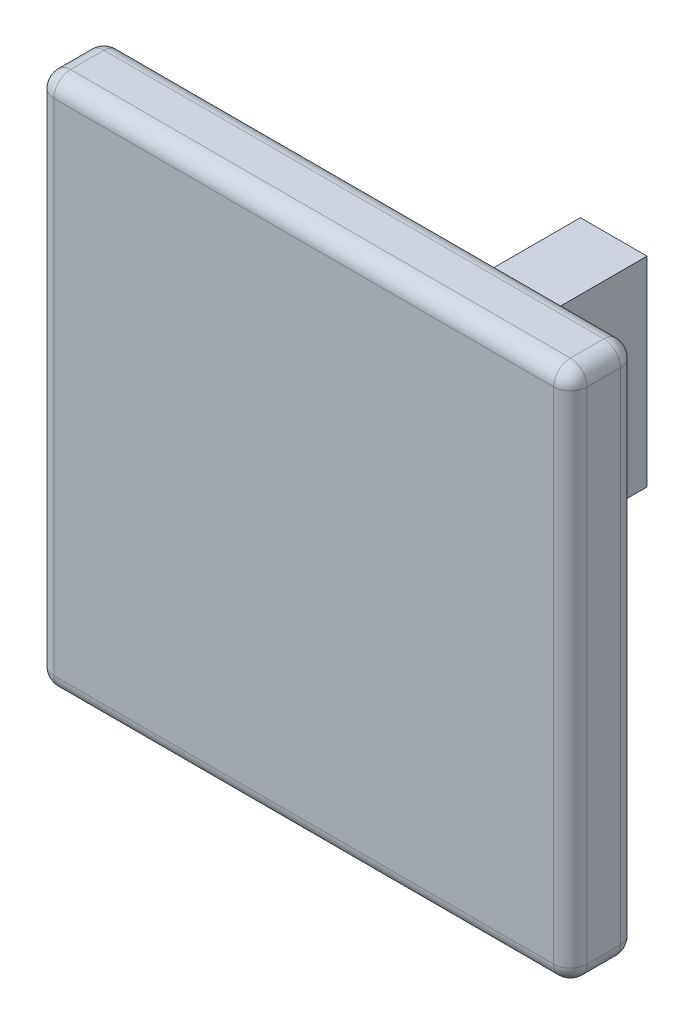
ISO-10303-21;
HEADER;
FILE_DESCRIPTION(('STEP AP214'),'2;1');
FILE_NAME('part.step','',(''),(''),'','','');
FILE_SCHEMA(('AUTOMOTIVE_DESIGN { 1 0 10303 214 1 1 1 1 }'));
ENDSEC;
DATA;
#1=APPLICATION_CONTEXT('core data for automotive mechanical design processes');
#2=APPLICATION_PROTOCOL_DEFINITION('international standard','automotive_design',2000,#1);
#3=PRODUCT_CONTEXT('',#1,'mechanical');
#4=PRODUCT('Part','Part','',(#3));
#5=PRODUCT_RELATED_PRODUCT_CATEGORY('part','',(#4));
#6=PRODUCT_DEFINITION_FORMATION('','',#4);
#7=PRODUCT_DEFINITION_CONTEXT('part definition',#1,'design');
#8=PRODUCT_DEFINITION('design','',#6,#7);
#9=PRODUCT_DEFINITION_SHAPE('','',#8);
#10=(LENGTH_UNIT() NAMED_UNIT(*) SI_UNIT(.MILLI.,.METRE.));
#11=(NAMED_UNIT(*) PLANE_ANGLE_UNIT() SI_UNIT($,.RADIAN.));
#12=(NAMED_UNIT(*) SI_UNIT($,.STERADIAN.) SOLID_ANGLE_UNIT());
#13=UNCERTAINTY_MEASURE_WITH_UNIT(LENGTH_MEASURE(1.E-05),#10,'distance_accuracy_value','');
#14=(GEOMETRIC_REPRESENTATION_CONTEXT(3) GLOBAL_UNCERTAINTY_ASSIGNED_CONTEXT((#13)) GLOBAL_UNIT_ASSIGNED_CONTEXT((#10,
#11,#12)) REPRESENTATION_CONTEXT('',''));
#15=CARTESIAN_POINT('',(0.,0.,0.));
#16=DIRECTION('',(0.,0.,1.));
#17=DIRECTION('',(1.,0.,0.));
#18=AXIS2_PLACEMENT_3D('',#15,#16,#17);
#19=CARTESIAN_POINT('',(0.,6.,0.));
#20=DIRECTION('',(1.,0.,0.));
#21=DIRECTION('',(0.,0.,-1.));
#22=AXIS2_PLACEMENT_3D('',#19,#20,#21);
#23=PLANE('',#22);
#24=DIRECTION('',(0.,0.,1.));
#25=VECTOR('',#24,1.);
#26=CARTESIAN_POINT('',(0.,0.,0.));
#27=LINE('',#26,#25);
#28=CARTESIAN_POINT('',(0.,0.,-7.3));
#29=VERTEX_POINT('',#28);
#30=CARTESIAN_POINT('',(0.,0.,0.));
#31=VERTEX_POINT('',#30);
#32=EDGE_CURVE('E154',#29,#31,#27,.T.);
#33=ORIENTED_EDGE('',*,*,#32,.T.);
#34=DIRECTION('',(0.,-1.,0.));
#35=VECTOR('',#34,1.);
#36=CARTESIAN_POINT('',(0.,6.,0.));
#37=LINE('',#36,#35);
#38=CARTESIAN_POINT('',(0.,6.,0.));
#39=VERTEX_POINT('',#38);
#40=EDGE_CURVE('E158',#39,#31,#37,.T.);
#41=ORIENTED_EDGE('',*,*,#40,.F.);
#42=DIRECTION('',(0.,0.,1.));
#43=VECTOR('',#42,1.);
#44=CARTESIAN_POINT('',(0.,6.,0.));
#45=LINE('',#44,#43);
#46=CARTESIAN_POINT('',(0.,6.,-7.3));
#47=VERTEX_POINT('',#46);
#48=EDGE_CURVE('E579',#47,#39,#45,.T.);
#49=ORIENTED_EDGE('',*,*,#48,.F.);
#50=DIRECTION('',(0.,-1.,0.));
#51=VECTOR('',#50,1.);
#52=CARTESIAN_POINT('',(0.,6.,-7.3));
#53=LINE('',#52,#51);
#54=EDGE_CURVE('E161',#47,#29,#53,.T.);
#55=ORIENTED_EDGE('',*,*,#54,.T.);
#56=EDGE_LOOP('',(#33,#41,#49,#55));
#57=FACE_BOUND('',#56,.T.);
#58=ADVANCED_FACE('F39',(#57),#23,.F.);
#59=CARTESIAN_POINT('',(2.,6.,0.));
#60=DIRECTION('',(-1.,0.,0.));
#61=DIRECTION('',(0.,0.,1.));
#62=AXIS2_PLACEMENT_3D('',#59,#60,#61);
#63=PLANE('',#62);
#64=DIRECTION('',(0.,0.,-1.));
#65=VECTOR('',#64,1.);
#66=CARTESIAN_POINT('',(2.,0.,0.));
#67=LINE('',#66,#65);
#68=CARTESIAN_POINT('',(2.,0.,0.));
#69=VERTEX_POINT('',#68);
#70=CARTESIAN_POINT('',(2.,0.,-7.3));
#71=VERTEX_POINT('',#70);
#72=EDGE_CURVE('E170',#69,#71,#67,.T.);
#73=ORIENTED_EDGE('',*,*,#72,.T.);
#74=DIRECTION('',(0.,-1.,0.));
#75=VECTOR('',#74,1.);
#76=CARTESIAN_POINT('',(2.,6.,-7.3));
#77=LINE('',#76,#75);
#78=CARTESIAN_POINT('',(2.,6.,-7.3));
#79=VERTEX_POINT('',#78);
#80=EDGE_CURVE('E185',#79,#71,#77,.T.);
#81=ORIENTED_EDGE('',*,*,#80,.F.);
#82=DIRECTION('',(0.,0.,-1.));
#83=VECTOR('',#82,1.);
#84=CARTESIAN_POINT('',(2.,6.,0.));
#85=LINE('',#84,#83);
#86=CARTESIAN_POINT('',(2.,6.,0.));
#87=VERTEX_POINT('',#86);
#88=EDGE_CURVE('E591',#87,#79,#85,.T.);
#89=ORIENTED_EDGE('',*,*,#88,.F.);
#90=DIRECTION('',(0.,-1.,0.));
#91=VECTOR('',#90,1.);
#92=CARTESIAN_POINT('',(2.,6.,0.));
#93=LINE('',#92,#91);
#94=EDGE_CURVE('E179',#87,#69,#93,.T.);
#95=ORIENTED_EDGE('',*,*,#94,.T.);
#96=EDGE_LOOP('',(#73,#81,#89,#95));
#97=FACE_BOUND('',#96,.T.);
#98=ADVANCED_FACE('F442',(#97),#63,.F.);
#99=CARTESIAN_POINT('',(0.,6.,-7.3));
#100=DIRECTION('',(0.,0.,1.));
#101=DIRECTION('',(1.,0.,0.));
#102=AXIS2_PLACEMENT_3D('',#99,#100,#101);
#103=PLANE('',#102);
#104=DIRECTION('',(-1.,0.,0.));
#105=VECTOR('',#104,1.);
#106=CARTESIAN_POINT('',(0.,0.,-7.3));
#107=LINE('',#106,#105);
#108=EDGE_CURVE('E575',#71,#29,#107,.T.);
#109=ORIENTED_EDGE('',*,*,#108,.T.);
#110=ORIENTED_EDGE('',*,*,#54,.F.);
#111=DIRECTION('',(-1.,0.,0.));
#112=VECTOR('',#111,1.);
#113=CARTESIAN_POINT('',(0.,6.,-7.3));
#114=LINE('',#113,#112);
#115=EDGE_CURVE('E587',#79,#47,#114,.T.);
#116=ORIENTED_EDGE('',*,*,#115,.F.);
#117=ORIENTED_EDGE('',*,*,#80,.T.);
#118=EDGE_LOOP('',(#109,#110,#116,#117));
#119=FACE_BOUND('',#118,.T.);
#120=ADVANCED_FACE('F447',(#119),#103,.F.);
#121=CARTESIAN_POINT('',(0.,6.,0.));
#122=DIRECTION('',(0.,-1.,0.));
#123=DIRECTION('',(0.,0.,-1.));
#124=AXIS2_PLACEMENT_3D('',#121,#122,#123);
#125=PLANE('',#124);
#126=ORIENTED_EDGE('',*,*,#48,.T.);
#127=DIRECTION('',(1.,0.,0.));
#128=VECTOR('',#127,1.);
#129=CARTESIAN_POINT('',(0.,6.,0.));
#130=LINE('',#129,#128);
#131=EDGE_CURVE('E176',#39,#87,#130,.T.);
#132=ORIENTED_EDGE('',*,*,#131,.T.);
#133=ORIENTED_EDGE('',*,*,#88,.T.);
#134=ORIENTED_EDGE('',*,*,#115,.T.);
#135=EDGE_LOOP('',(#126,#132,#133,#134));
#136=FACE_BOUND('',#135,.T.);
#137=ADVANCED_FACE('F543',(#136),#125,.F.);
#138=CARTESIAN_POINT('',(0.,0.,0.));
#139=DIRECTION('',(0.,-1.,0.));
#140=DIRECTION('',(0.,0.,-1.));
#141=AXIS2_PLACEMENT_3D('',#138,#139,#140);
#142=PLANE('',#141);
#143=ORIENTED_EDGE('',*,*,#32,.F.);
#144=ORIENTED_EDGE('',*,*,#108,.F.);
#145=ORIENTED_EDGE('',*,*,#72,.F.);
#146=DIRECTION('',(1.,0.,0.));
#147=VECTOR('',#146,1.);
#148=CARTESIAN_POINT('',(0.,0.,0.));
#149=LINE('',#148,#147);
#150=EDGE_CURVE('E165',#31,#69,#149,.T.);
#151=ORIENTED_EDGE('',*,*,#150,.F.);
#152=EDGE_LOOP('',(#143,#144,#145,#151));
#153=FACE_BOUND('',#152,.T.);
#154=ADVANCED_FACE('F169',(#153),#142,.T.);
#155=CARTESIAN_POINT('',(0.,0.,0.));
#156=DIRECTION('',(0.,0.,1.));
#157=DIRECTION('',(1.,0.,0.));
#158=AXIS2_PLACEMENT_3D('',#155,#156,#157);
#159=PLANE('',#158);
#160=DIRECTION('',(0.,-1.,0.));
#161=VECTOR('',#160,1.);
#162=CARTESIAN_POINT('',(-6.5,0.,0.));
#163=LINE('',#162,#161);
#164=CARTESIAN_POINT('',(-6.5,-4.5,0.));
#165=VERTEX_POINT('',#164);
#166=CARTESIAN_POINT('',(-6.5,10.5,0.));
#167=VERTEX_POINT('',#166);
#168=EDGE_CURVE('E198',#165,#167,#163,.F.);
#169=ORIENTED_EDGE('',*,*,#168,.T.);
#170=DIRECTION('',(-1.,0.,0.));
#171=VECTOR('',#170,1.);
#172=CARTESIAN_POINT('',(0.,10.5,0.));
#173=LINE('',#172,#171);
#174=CARTESIAN_POINT('',(8.5,10.5,0.));
#175=VERTEX_POINT('',#174);
#176=EDGE_CURVE('E207',#167,#175,#173,.F.);
#177=ORIENTED_EDGE('',*,*,#176,.T.);
#178=DIRECTION('',(0.,1.,0.));
#179=VECTOR('',#178,1.);
#180=CARTESIAN_POINT('',(8.5,0.,0.));
#181=LINE('',#180,#179);
#182=CARTESIAN_POINT('',(8.5,-4.5,0.));
#183=VERTEX_POINT('',#182);
#184=EDGE_CURVE('E204',#175,#183,#181,.F.);
#185=ORIENTED_EDGE('',*,*,#184,.T.);
#186=DIRECTION('',(1.,0.,0.));
#187=VECTOR('',#186,1.);
#188=CARTESIAN_POINT('',(0.,-4.5,0.));
#189=LINE('',#188,#187);
#190=EDGE_CURVE('E201',#183,#165,#189,.F.);
#191=ORIENTED_EDGE('',*,*,#190,.T.);
#192=EDGE_LOOP('',(#169,#177,#185,#191));
#193=FACE_BOUND('',#192,.T.);
#194=ORIENTED_EDGE('',*,*,#40,.T.);
#195=ORIENTED_EDGE('',*,*,#150,.T.);
#196=ORIENTED_EDGE('',*,*,#94,.F.);
#197=ORIENTED_EDGE('',*,*,#131,.F.);
#198=EDGE_LOOP('',(#194,#195,#196,#197));
#199=FACE_BOUND('',#198,.T.);
#200=ADVANCED_FACE('F175',(#193,#199),#159,.F.);
#201=CARTESIAN_POINT('',(-7.,11.,2.));
#202=DIRECTION('',(1.,0.,0.));
#203=DIRECTION('',(0.,1.,0.));
#204=AXIS2_PLACEMENT_3D('',#201,#202,#203);
#205=PLANE('',#204);
#206=DIRECTION('',(0.,-1.,0.));
#207=VECTOR('',#206,1.);
#208=CARTESIAN_POINT('',(-7.,11.,1.5));
#209=LINE('',#208,#207);
#210=CARTESIAN_POINT('',(-7.,-4.5,1.5));
#211=VERTEX_POINT('',#210);
#212=CARTESIAN_POINT('',(-7.,10.5,1.5));
#213=VERTEX_POINT('',#212);
#214=EDGE_CURVE('E49',#211,#213,#209,.F.);
#215=ORIENTED_EDGE('',*,*,#214,.T.);
#216=DIRECTION('',(0.,0.,-1.));
#217=VECTOR('',#216,1.);
#218=CARTESIAN_POINT('',(-7.,10.5,2.));
#219=LINE('',#218,#217);
#220=CARTESIAN_POINT('',(-7.,10.5,0.5));
#221=VERTEX_POINT('',#220);
#222=EDGE_CURVE('E11',#213,#221,#219,.T.);
#223=ORIENTED_EDGE('',*,*,#222,.T.);
#224=DIRECTION('',(0.,-1.,0.));
#225=VECTOR('',#224,1.);
#226=CARTESIAN_POINT('',(-7.,11.,0.5));
#227=LINE('',#226,#225);
#228=CARTESIAN_POINT('',(-7.,-4.5,0.5));
#229=VERTEX_POINT('',#228);
#230=EDGE_CURVE('E250',#221,#229,#227,.T.);
#231=ORIENTED_EDGE('',*,*,#230,.T.);
#232=DIRECTION('',(0.,0.,-1.));
#233=VECTOR('',#232,1.);
#234=CARTESIAN_POINT('',(-7.,-4.5,2.));
#235=LINE('',#234,#233);
#236=EDGE_CURVE('E60',#229,#211,#235,.F.);
#237=ORIENTED_EDGE('',*,*,#236,.T.);
#238=EDGE_LOOP('',(#215,#223,#231,#237));
#239=FACE_BOUND('',#238,.T.);
#240=ADVANCED_FACE('F519',(#239),#205,.F.);
#241=CARTESIAN_POINT('',(-7.,-5.,2.));
#242=DIRECTION('',(0.,1.,0.));
#243=DIRECTION('',(-1.,0.,0.));
#244=AXIS2_PLACEMENT_3D('',#241,#242,#243);
#245=PLANE('',#244);
#246=DIRECTION('',(1.,0.,0.));
#247=VECTOR('',#246,1.);
#248=CARTESIAN_POINT('',(-7.,-5.,0.5));
#249=LINE('',#248,#247);
#250=CARTESIAN_POINT('',(-6.5,-5.,0.5));
#251=VERTEX_POINT('',#250);
#252=CARTESIAN_POINT('',(8.5,-5.,0.5));
#253=VERTEX_POINT('',#252);
#254=EDGE_CURVE('E230',#251,#253,#249,.T.);
#255=ORIENTED_EDGE('',*,*,#254,.T.);
#256=DIRECTION('',(0.,0.,-1.));
#257=VECTOR('',#256,1.);
#258=CARTESIAN_POINT('',(8.5,-5.,2.));
#259=LINE('',#258,#257);
#260=CARTESIAN_POINT('',(8.5,-5.,1.5));
#261=VERTEX_POINT('',#260);
#262=EDGE_CURVE('E233',#253,#261,#259,.F.);
#263=ORIENTED_EDGE('',*,*,#262,.T.);
#264=DIRECTION('',(1.,0.,0.));
#265=VECTOR('',#264,1.);
#266=CARTESIAN_POINT('',(-7.,-5.,1.5));
#267=LINE('',#266,#265);
#268=CARTESIAN_POINT('',(-6.5,-5.,1.5));
#269=VERTEX_POINT('',#268);
#270=EDGE_CURVE('E227',#261,#269,#267,.F.);
#271=ORIENTED_EDGE('',*,*,#270,.T.);
#272=DIRECTION('',(0.,0.,-1.));
#273=VECTOR('',#272,1.);
#274=CARTESIAN_POINT('',(-6.5,-5.,2.));
#275=LINE('',#274,#273);
#276=EDGE_CURVE('E224',#269,#251,#275,.T.);
#277=ORIENTED_EDGE('',*,*,#276,.T.);
#278=EDGE_LOOP('',(#255,#263,#271,#277));
#279=FACE_BOUND('',#278,.T.);
#280=ADVANCED_FACE('F358',(#279),#245,.F.);
#281=CARTESIAN_POINT('',(9.,11.,2.));
#282=DIRECTION('',(-1.,0.,0.));
#283=DIRECTION('',(0.,-1.,0.));
#284=AXIS2_PLACEMENT_3D('',#281,#282,#283);
#285=PLANE('',#284);
#286=DIRECTION('',(0.,1.,0.));
#287=VECTOR('',#286,1.);
#288=CARTESIAN_POINT('',(9.,11.,0.5));
#289=LINE('',#288,#287);
#290=CARTESIAN_POINT('',(9.,-4.5,0.5));
#291=VERTEX_POINT('',#290);
#292=CARTESIAN_POINT('',(9.,10.5,0.5));
#293=VERTEX_POINT('',#292);
#294=EDGE_CURVE('E217',#291,#293,#289,.T.);
#295=ORIENTED_EDGE('',*,*,#294,.T.);
#296=DIRECTION('',(0.,0.,-1.));
#297=VECTOR('',#296,1.);
#298=CARTESIAN_POINT('',(9.,10.5,2.));
#299=LINE('',#298,#297);
#300=CARTESIAN_POINT('',(9.,10.5,1.5));
#301=VERTEX_POINT('',#300);
#302=EDGE_CURVE('E220',#293,#301,#299,.F.);
#303=ORIENTED_EDGE('',*,*,#302,.T.);
#304=DIRECTION('',(0.,1.,0.));
#305=VECTOR('',#304,1.);
#306=CARTESIAN_POINT('',(9.,-5.,1.5));
#307=LINE('',#306,#305);
#308=CARTESIAN_POINT('',(9.,-4.5,1.5));
#309=VERTEX_POINT('',#308);
#310=EDGE_CURVE('E211',#301,#309,#307,.F.);
#311=ORIENTED_EDGE('',*,*,#310,.T.);
#312=DIRECTION('',(0.,0.,-1.));
#313=VECTOR('',#312,1.);
#314=CARTESIAN_POINT('',(9.,-4.5,2.));
#315=LINE('',#314,#313);
#316=EDGE_CURVE('E214',#309,#291,#315,.T.);
#317=ORIENTED_EDGE('',*,*,#316,.T.);
#318=EDGE_LOOP('',(#295,#303,#311,#317));
#319=FACE_BOUND('',#318,.T.);
#320=ADVANCED_FACE('F379',(#319),#285,.F.);
#321=CARTESIAN_POINT('',(-7.,11.,2.));
#322=DIRECTION('',(0.,-1.,0.));
#323=DIRECTION('',(0.,0.,-1.));
#324=AXIS2_PLACEMENT_3D('',#321,#322,#323);
#325=PLANE('',#324);
#326=DIRECTION('',(0.,0.,-1.));
#327=VECTOR('',#326,1.);
#328=CARTESIAN_POINT('',(8.5,11.,2.));
#329=LINE('',#328,#327);
#330=CARTESIAN_POINT('',(8.5,11.,1.5));
#331=VERTEX_POINT('',#330);
#332=CARTESIAN_POINT('',(8.5,11.,0.5));
#333=VERTEX_POINT('',#332);
#334=EDGE_CURVE('E191',#331,#333,#329,.T.);
#335=ORIENTED_EDGE('',*,*,#334,.T.);
#336=DIRECTION('',(-1.,0.,0.));
#337=VECTOR('',#336,1.);
#338=CARTESIAN_POINT('',(-7.,11.,0.5));
#339=LINE('',#338,#337);
#340=CARTESIAN_POINT('',(-6.5,11.,0.5));
#341=VERTEX_POINT('',#340);
#342=EDGE_CURVE('E194',#333,#341,#339,.T.);
#343=ORIENTED_EDGE('',*,*,#342,.T.);
#344=DIRECTION('',(0.,0.,-1.));
#345=VECTOR('',#344,1.);
#346=CARTESIAN_POINT('',(-6.5,11.,2.));
#347=LINE('',#346,#345);
#348=CARTESIAN_POINT('',(-6.5,11.,1.5));
#349=VERTEX_POINT('',#348);
#350=EDGE_CURVE('E178',#341,#349,#347,.F.);
#351=ORIENTED_EDGE('',*,*,#350,.T.);
#352=DIRECTION('',(-1.,0.,0.));
#353=VECTOR('',#352,1.);
#354=CARTESIAN_POINT('',(9.,11.,1.5));
#355=LINE('',#354,#353);
#356=EDGE_CURVE('E183',#349,#331,#355,.F.);
#357=ORIENTED_EDGE('',*,*,#356,.T.);
#358=EDGE_LOOP('',(#335,#343,#351,#357));
#359=FACE_BOUND('',#358,.T.);
#360=ADVANCED_FACE('F431',(#359),#325,.F.);
#361=CARTESIAN_POINT('',(0.,0.,2.));
#362=DIRECTION('',(0.,0.,1.));
#363=DIRECTION('',(1.,0.,0.));
#364=AXIS2_PLACEMENT_3D('',#361,#362,#363);
#365=PLANE('',#364);
#366=DIRECTION('',(0.,1.,0.));
#367=VECTOR('',#366,1.);
#368=CARTESIAN_POINT('',(8.5,11.,2.));
#369=LINE('',#368,#367);
#370=CARTESIAN_POINT('',(8.5,-4.5,2.));
#371=VERTEX_POINT('',#370);
#372=CARTESIAN_POINT('',(8.5,10.5,2.));
#373=VERTEX_POINT('',#372);
#374=EDGE_CURVE('E243',#371,#373,#369,.T.);
#375=ORIENTED_EDGE('',*,*,#374,.T.);
#376=DIRECTION('',(-1.,0.,0.));
#377=VECTOR('',#376,1.);
#378=CARTESIAN_POINT('',(-7.,10.5,2.));
#379=LINE('',#378,#377);
#380=CARTESIAN_POINT('',(-6.5,10.5,2.));
#381=VERTEX_POINT('',#380);
#382=EDGE_CURVE('E246',#373,#381,#379,.T.);
#383=ORIENTED_EDGE('',*,*,#382,.T.);
#384=DIRECTION('',(0.,-1.,0.));
#385=VECTOR('',#384,1.);
#386=CARTESIAN_POINT('',(-6.5,-5.,2.));
#387=LINE('',#386,#385);
#388=CARTESIAN_POINT('',(-6.5,-4.5,2.));
#389=VERTEX_POINT('',#388);
#390=EDGE_CURVE('E237',#381,#389,#387,.T.);
#391=ORIENTED_EDGE('',*,*,#390,.T.);
#392=DIRECTION('',(1.,0.,0.));
#393=VECTOR('',#392,1.);
#394=CARTESIAN_POINT('',(9.,-4.5,2.));
#395=LINE('',#394,#393);
#396=EDGE_CURVE('E240',#389,#371,#395,.T.);
#397=ORIENTED_EDGE('',*,*,#396,.T.);
#398=EDGE_LOOP('',(#375,#383,#391,#397));
#399=FACE_BOUND('',#398,.T.);
#400=ADVANCED_FACE('F395',(#399),#365,.T.);
#401=CARTESIAN_POINT('',(0.,-4.5,1.5));
#402=DIRECTION('',(-1.,0.,0.));
#403=DIRECTION('',(0.,-1.,0.));
#404=AXIS2_PLACEMENT_3D('',#401,#402,#403);
#405=CYLINDRICAL_SURFACE('',#404,0.5);
#406=CARTESIAN_POINT('',(8.5,-4.5,1.5));
#407=DIRECTION('',(1.,0.,0.));
#408=DIRECTION('',(0.,0.,-1.));
#409=AXIS2_PLACEMENT_3D('',#406,#407,#408);
#410=CIRCLE('',#409,0.5);
#411=EDGE_CURVE('E43',#371,#261,#410,.T.);
#412=ORIENTED_EDGE('',*,*,#411,.F.);
#413=ORIENTED_EDGE('',*,*,#396,.F.);
#414=CARTESIAN_POINT('',(-6.5,-4.5,1.5));
#415=DIRECTION('',(-1.,0.,0.));
#416=DIRECTION('',(0.,0.,1.));
#417=AXIS2_PLACEMENT_3D('',#414,#415,#416);
#418=CIRCLE('',#417,0.5);
#419=EDGE_CURVE('E337',#269,#389,#418,.T.);
#420=ORIENTED_EDGE('',*,*,#419,.F.);
#421=ORIENTED_EDGE('',*,*,#270,.F.);
#422=EDGE_LOOP('',(#412,#413,#420,#421));
#423=FACE_BOUND('',#422,.T.);
#424=ADVANCED_FACE('F41',(#423),#405,.T.);
#425=CARTESIAN_POINT('',(8.5,-4.5,1.5));
#426=DIRECTION('',(0.,0.,1.));
#427=DIRECTION('',(1.,0.,0.));
#428=AXIS2_PLACEMENT_3D('',#425,#426,#427);
#429=SPHERICAL_SURFACE('',#428,0.5);
#430=CARTESIAN_POINT('',(8.5,-4.5,1.5));
#431=DIRECTION('',(0.,-1.,0.));
#432=DIRECTION('',(0.,0.,-1.));
#433=AXIS2_PLACEMENT_3D('',#430,#431,#432);
#434=CIRCLE('',#433,0.5);
#435=EDGE_CURVE('E331',#371,#309,#434,.F.);
#436=ORIENTED_EDGE('',*,*,#435,.F.);
#437=ORIENTED_EDGE('',*,*,#411,.T.);
#438=CARTESIAN_POINT('',(8.5,-4.5,1.5));
#439=DIRECTION('',(0.,0.,1.));
#440=DIRECTION('',(1.,0.,0.));
#441=AXIS2_PLACEMENT_3D('',#438,#439,#440);
#442=CIRCLE('',#441,0.5);
#443=EDGE_CURVE('E335',#309,#261,#442,.F.);
#444=ORIENTED_EDGE('',*,*,#443,.F.);
#445=EDGE_LOOP('',(#436,#437,#444));
#446=FACE_BOUND('',#445,.T.);
#447=ADVANCED_FACE('F351',(#446),#429,.T.);
#448=CARTESIAN_POINT('',(-6.5,-4.5,1.5));
#449=DIRECTION('',(0.,0.,1.));
#450=DIRECTION('',(1.,0.,0.));
#451=AXIS2_PLACEMENT_3D('',#448,#449,#450);
#452=SPHERICAL_SURFACE('',#451,0.5);
#453=CARTESIAN_POINT('',(-6.5,-4.5,1.5));
#454=DIRECTION('',(0.,0.,1.));
#455=DIRECTION('',(1.,0.,0.));
#456=AXIS2_PLACEMENT_3D('',#453,#454,#455);
#457=CIRCLE('',#456,0.5);
#458=EDGE_CURVE('E324',#269,#211,#457,.F.);
#459=ORIENTED_EDGE('',*,*,#458,.F.);
#460=ORIENTED_EDGE('',*,*,#419,.T.);
#461=CARTESIAN_POINT('',(-6.5,-4.5,1.5));
#462=DIRECTION('',(0.,-1.,0.));
#463=DIRECTION('',(0.,0.,-1.));
#464=AXIS2_PLACEMENT_3D('',#461,#462,#463);
#465=CIRCLE('',#464,0.5);
#466=EDGE_CURVE('E327',#211,#389,#465,.F.);
#467=ORIENTED_EDGE('',*,*,#466,.F.);
#468=EDGE_LOOP('',(#459,#460,#467));
#469=FACE_BOUND('',#468,.T.);
#470=ADVANCED_FACE('F405',(#469),#452,.T.);
#471=CARTESIAN_POINT('',(8.5,-4.5,2.));
#472=DIRECTION('',(0.,0.,-1.));
#473=DIRECTION('',(-1.,0.,0.));
#474=AXIS2_PLACEMENT_3D('',#471,#472,#473);
#475=CYLINDRICAL_SURFACE('',#474,0.5);
#476=ORIENTED_EDGE('',*,*,#443,.T.);
#477=ORIENTED_EDGE('',*,*,#262,.F.);
#478=CARTESIAN_POINT('',(8.5,-4.5,0.5));
#479=DIRECTION('',(0.,0.,-1.));
#480=DIRECTION('',(-1.,0.,0.));
#481=AXIS2_PLACEMENT_3D('',#478,#479,#480);
#482=CIRCLE('',#481,0.5);
#483=EDGE_CURVE('E316',#291,#253,#482,.T.);
#484=ORIENTED_EDGE('',*,*,#483,.F.);
#485=ORIENTED_EDGE('',*,*,#316,.F.);
#486=EDGE_LOOP('',(#476,#477,#484,#485));
#487=FACE_BOUND('',#486,.T.);
#488=ADVANCED_FACE('F363',(#487),#475,.T.);
#489=CARTESIAN_POINT('',(8.5,0.,1.5));
#490=DIRECTION('',(0.,-1.,0.));
#491=DIRECTION('',(1.,0.,0.));
#492=AXIS2_PLACEMENT_3D('',#489,#490,#491);
#493=CYLINDRICAL_SURFACE('',#492,0.5);
#494=ORIENTED_EDGE('',*,*,#435,.T.);
#495=ORIENTED_EDGE('',*,*,#310,.F.);
#496=CARTESIAN_POINT('',(8.5,10.5,1.5));
#497=DIRECTION('',(0.,1.,0.));
#498=DIRECTION('',(0.,0.,1.));
#499=AXIS2_PLACEMENT_3D('',#496,#497,#498);
#500=CIRCLE('',#499,0.5);
#501=EDGE_CURVE('E312',#373,#301,#500,.T.);
#502=ORIENTED_EDGE('',*,*,#501,.F.);
#503=ORIENTED_EDGE('',*,*,#374,.F.);
#504=EDGE_LOOP('',(#494,#495,#502,#503));
#505=FACE_BOUND('',#504,.T.);
#506=ADVANCED_FACE('F392',(#505),#493,.T.);
#507=CARTESIAN_POINT('',(0.,10.5,1.5));
#508=DIRECTION('',(1.,0.,0.));
#509=DIRECTION('',(0.,0.,-1.));
#510=AXIS2_PLACEMENT_3D('',#507,#508,#509);
#511=CYLINDRICAL_SURFACE('',#510,0.5);
#512=CARTESIAN_POINT('',(-6.5,10.5,1.5));
#513=DIRECTION('',(-1.,0.,0.));
#514=DIRECTION('',(0.,0.,1.));
#515=AXIS2_PLACEMENT_3D('',#512,#513,#514);
#516=CIRCLE('',#515,0.5);
#517=EDGE_CURVE('E304',#381,#349,#516,.T.);
#518=ORIENTED_EDGE('',*,*,#517,.F.);
#519=ORIENTED_EDGE('',*,*,#382,.F.);
#520=CARTESIAN_POINT('',(8.5,10.5,1.5));
#521=DIRECTION('',(1.,0.,0.));
#522=DIRECTION('',(0.,0.,-1.));
#523=AXIS2_PLACEMENT_3D('',#520,#521,#522);
#524=CIRCLE('',#523,0.5);
#525=EDGE_CURVE('E308',#331,#373,#524,.T.);
#526=ORIENTED_EDGE('',*,*,#525,.F.);
#527=ORIENTED_EDGE('',*,*,#356,.F.);
#528=EDGE_LOOP('',(#518,#519,#526,#527));
#529=FACE_BOUND('',#528,.T.);
#530=ADVANCED_FACE('F398',(#529),#511,.T.);
#531=CARTESIAN_POINT('',(-6.5,0.,1.5));
#532=DIRECTION('',(0.,1.,0.));
#533=DIRECTION('',(-1.,0.,0.));
#534=AXIS2_PLACEMENT_3D('',#531,#532,#533);
#535=CYLINDRICAL_SURFACE('',#534,0.5);
#536=ORIENTED_EDGE('',*,*,#466,.T.);
#537=ORIENTED_EDGE('',*,*,#390,.F.);
#538=CARTESIAN_POINT('',(-6.5,10.5,1.5));
#539=DIRECTION('',(0.,1.,0.));
#540=DIRECTION('',(0.,0.,1.));
#541=AXIS2_PLACEMENT_3D('',#538,#539,#540);
#542=CIRCLE('',#541,0.5);
#543=EDGE_CURVE('E301',#213,#381,#542,.T.);
#544=ORIENTED_EDGE('',*,*,#543,.F.);
#545=ORIENTED_EDGE('',*,*,#214,.F.);
#546=EDGE_LOOP('',(#536,#537,#544,#545));
#547=FACE_BOUND('',#546,.T.);
#548=ADVANCED_FACE('F404',(#547),#535,.T.);
#549=CARTESIAN_POINT('',(-6.5,-4.5,2.));
#550=DIRECTION('',(0.,0.,-1.));
#551=DIRECTION('',(-1.,0.,0.));
#552=AXIS2_PLACEMENT_3D('',#549,#550,#551);
#553=CYLINDRICAL_SURFACE('',#552,0.5);
#554=ORIENTED_EDGE('',*,*,#458,.T.);
#555=ORIENTED_EDGE('',*,*,#236,.F.);
#556=CARTESIAN_POINT('',(-6.5,-4.5,0.5));
#557=DIRECTION('',(0.,0.,-1.));
#558=DIRECTION('',(-1.,0.,0.));
#559=AXIS2_PLACEMENT_3D('',#556,#557,#558);
#560=CIRCLE('',#559,0.5);
#561=EDGE_CURVE('E297',#251,#229,#560,.T.);
#562=ORIENTED_EDGE('',*,*,#561,.F.);
#563=ORIENTED_EDGE('',*,*,#276,.F.);
#564=EDGE_LOOP('',(#554,#555,#562,#563));
#565=FACE_BOUND('',#564,.T.);
#566=ADVANCED_FACE('F408',(#565),#553,.T.);
#567=CARTESIAN_POINT('',(-7.,-4.5,0.5));
#568=DIRECTION('',(1.,0.,0.));
#569=DIRECTION('',(0.,1.,0.));
#570=AXIS2_PLACEMENT_3D('',#567,#568,#569);
#571=CYLINDRICAL_SURFACE('',#570,0.5);
#572=CARTESIAN_POINT('',(8.5,-4.5,0.5));
#573=DIRECTION('',(1.,0.,0.));
#574=DIRECTION('',(0.,0.,-1.));
#575=AXIS2_PLACEMENT_3D('',#572,#573,#574);
#576=CIRCLE('',#575,0.5);
#577=EDGE_CURVE('E320',#253,#183,#576,.T.);
#578=ORIENTED_EDGE('',*,*,#577,.F.);
#579=ORIENTED_EDGE('',*,*,#254,.F.);
#580=CARTESIAN_POINT('',(-6.5,-4.5,0.5));
#581=DIRECTION('',(-1.,0.,0.));
#582=DIRECTION('',(0.,0.,1.));
#583=AXIS2_PLACEMENT_3D('',#580,#581,#582);
#584=CIRCLE('',#583,0.5);
#585=EDGE_CURVE('E293',#165,#251,#584,.T.);
#586=ORIENTED_EDGE('',*,*,#585,.F.);
#587=ORIENTED_EDGE('',*,*,#190,.F.);
#588=EDGE_LOOP('',(#578,#579,#586,#587));
#589=FACE_BOUND('',#588,.T.);
#590=ADVANCED_FACE('F367',(#589),#571,.T.);
#591=CARTESIAN_POINT('',(8.5,-4.5,0.5));
#592=DIRECTION('',(0.,0.,1.));
#593=DIRECTION('',(1.,0.,0.));
#594=AXIS2_PLACEMENT_3D('',#591,#592,#593);
#595=SPHERICAL_SURFACE('',#594,0.5);
#596=ORIENTED_EDGE('',*,*,#483,.T.);
#597=ORIENTED_EDGE('',*,*,#577,.T.);
#598=CARTESIAN_POINT('',(8.5,-4.5,0.5));
#599=DIRECTION('',(0.,-1.,0.));
#600=DIRECTION('',(1.,0.,0.));
#601=AXIS2_PLACEMENT_3D('',#598,#599,#600);
#602=CIRCLE('',#601,0.5);
#603=EDGE_CURVE('E289',#291,#183,#602,.F.);
#604=ORIENTED_EDGE('',*,*,#603,.F.);
#605=EDGE_LOOP('',(#596,#597,#604));
#606=FACE_BOUND('',#605,.T.);
#607=ADVANCED_FACE('F371',(#606),#595,.T.);
#608=CARTESIAN_POINT('',(8.5,10.5,1.5));
#609=DIRECTION('',(0.,0.,1.));
#610=DIRECTION('',(1.,0.,0.));
#611=AXIS2_PLACEMENT_3D('',#608,#609,#610);
#612=SPHERICAL_SURFACE('',#611,0.5);
#613=ORIENTED_EDGE('',*,*,#525,.T.);
#614=ORIENTED_EDGE('',*,*,#501,.T.);
#615=CARTESIAN_POINT('',(8.5,10.5,1.5));
#616=DIRECTION('',(0.,0.,1.));
#617=DIRECTION('',(1.,0.,0.));
#618=AXIS2_PLACEMENT_3D('',#615,#616,#617);
#619=CIRCLE('',#618,0.5);
#620=EDGE_CURVE('E286',#331,#301,#619,.F.);
#621=ORIENTED_EDGE('',*,*,#620,.F.);
#622=EDGE_LOOP('',(#613,#614,#621));
#623=FACE_BOUND('',#622,.T.);
#624=ADVANCED_FACE('F389',(#623),#612,.T.);
#625=CARTESIAN_POINT('',(-6.5,10.5,1.5));
#626=DIRECTION('',(0.,0.,1.));
#627=DIRECTION('',(1.,0.,0.));
#628=AXIS2_PLACEMENT_3D('',#625,#626,#627);
#629=SPHERICAL_SURFACE('',#628,0.5);
#630=ORIENTED_EDGE('',*,*,#543,.T.);
#631=ORIENTED_EDGE('',*,*,#517,.T.);
#632=CARTESIAN_POINT('',(-6.5,10.5,1.5));
#633=DIRECTION('',(0.,0.,1.));
#634=DIRECTION('',(1.,0.,0.));
#635=AXIS2_PLACEMENT_3D('',#632,#633,#634);
#636=CIRCLE('',#635,0.5);
#637=EDGE_CURVE('E282',#213,#349,#636,.F.);
#638=ORIENTED_EDGE('',*,*,#637,.F.);
#639=EDGE_LOOP('',(#630,#631,#638));
#640=FACE_BOUND('',#639,.T.);
#641=ADVANCED_FACE('F470',(#640),#629,.T.);
#642=CARTESIAN_POINT('',(-6.5,-4.5,0.5));
#643=DIRECTION('',(0.,0.,1.));
#644=DIRECTION('',(1.,0.,0.));
#645=AXIS2_PLACEMENT_3D('',#642,#643,#644);
#646=SPHERICAL_SURFACE('',#645,0.5);
#647=ORIENTED_EDGE('',*,*,#585,.T.);
#648=ORIENTED_EDGE('',*,*,#561,.T.);
#649=CARTESIAN_POINT('',(-6.5,-4.5,0.5));
#650=DIRECTION('',(0.,-1.,0.));
#651=DIRECTION('',(0.,0.,-1.));
#652=AXIS2_PLACEMENT_3D('',#649,#650,#651);
#653=CIRCLE('',#652,0.5);
#654=EDGE_CURVE('E278',#165,#229,#653,.F.);
#655=ORIENTED_EDGE('',*,*,#654,.F.);
#656=EDGE_LOOP('',(#647,#648,#655));
#657=FACE_BOUND('',#656,.T.);
#658=ADVANCED_FACE('F411',(#657),#646,.T.);
#659=CARTESIAN_POINT('',(8.5,11.,0.5));
#660=DIRECTION('',(0.,1.,0.));
#661=DIRECTION('',(-1.,0.,0.));
#662=AXIS2_PLACEMENT_3D('',#659,#660,#661);
#663=CYLINDRICAL_SURFACE('',#662,0.5);
#664=ORIENTED_EDGE('',*,*,#603,.T.);
#665=ORIENTED_EDGE('',*,*,#184,.F.);
#666=CARTESIAN_POINT('',(8.5,10.5,0.5));
#667=DIRECTION('',(0.,1.,0.));
#668=DIRECTION('',(0.,0.,1.));
#669=AXIS2_PLACEMENT_3D('',#666,#667,#668);
#670=CIRCLE('',#669,0.5);
#671=EDGE_CURVE('E274',#293,#175,#670,.T.);
#672=ORIENTED_EDGE('',*,*,#671,.F.);
#673=ORIENTED_EDGE('',*,*,#294,.F.);
#674=EDGE_LOOP('',(#664,#665,#672,#673));
#675=FACE_BOUND('',#674,.T.);
#676=ADVANCED_FACE('F376',(#675),#663,.T.);
#677=CARTESIAN_POINT('',(8.5,10.5,2.));
#678=DIRECTION('',(0.,0.,-1.));
#679=DIRECTION('',(-1.,0.,0.));
#680=AXIS2_PLACEMENT_3D('',#677,#678,#679);
#681=CYLINDRICAL_SURFACE('',#680,0.5);
#682=ORIENTED_EDGE('',*,*,#620,.T.);
#683=ORIENTED_EDGE('',*,*,#302,.F.);
#684=CARTESIAN_POINT('',(8.5,10.5,0.5));
#685=DIRECTION('',(0.,0.,-1.));
#686=DIRECTION('',(-1.,0.,0.));
#687=AXIS2_PLACEMENT_3D('',#684,#685,#686);
#688=CIRCLE('',#687,0.5);
#689=EDGE_CURVE('E270',#333,#293,#688,.T.);
#690=ORIENTED_EDGE('',*,*,#689,.F.);
#691=ORIENTED_EDGE('',*,*,#334,.F.);
#692=EDGE_LOOP('',(#682,#683,#690,#691));
#693=FACE_BOUND('',#692,.T.);
#694=ADVANCED_FACE('F382',(#693),#681,.T.);
#695=CARTESIAN_POINT('',(-6.5,10.5,2.));
#696=DIRECTION('',(0.,0.,-1.));
#697=DIRECTION('',(-1.,0.,0.));
#698=AXIS2_PLACEMENT_3D('',#695,#696,#697);
#699=CYLINDRICAL_SURFACE('',#698,0.5);
#700=ORIENTED_EDGE('',*,*,#637,.T.);
#701=ORIENTED_EDGE('',*,*,#350,.F.);
#702=CARTESIAN_POINT('',(-6.5,10.5,0.5));
#703=DIRECTION('',(0.,0.,-1.));
#704=DIRECTION('',(-1.,0.,0.));
#705=AXIS2_PLACEMENT_3D('',#702,#703,#704);
#706=CIRCLE('',#705,0.5);
#707=EDGE_CURVE('E266',#221,#341,#706,.T.);
#708=ORIENTED_EDGE('',*,*,#707,.F.);
#709=ORIENTED_EDGE('',*,*,#222,.F.);
#710=EDGE_LOOP('',(#700,#701,#708,#709));
#711=FACE_BOUND('',#710,.T.);
#712=ADVANCED_FACE('F429',(#711),#699,.T.);
#713=CARTESIAN_POINT('',(-6.5,11.,0.5));
#714=DIRECTION('',(0.,-1.,0.));
#715=DIRECTION('',(1.,0.,0.));
#716=AXIS2_PLACEMENT_3D('',#713,#714,#715);
#717=CYLINDRICAL_SURFACE('',#716,0.5);
#718=ORIENTED_EDGE('',*,*,#654,.T.);
#719=ORIENTED_EDGE('',*,*,#230,.F.);
#720=CARTESIAN_POINT('',(-6.5,10.5,0.5));
#721=DIRECTION('',(0.,1.,0.));
#722=DIRECTION('',(0.,0.,1.));
#723=AXIS2_PLACEMENT_3D('',#720,#721,#722);
#724=CIRCLE('',#723,0.5);
#725=EDGE_CURVE('E263',#167,#221,#724,.T.);
#726=ORIENTED_EDGE('',*,*,#725,.F.);
#727=ORIENTED_EDGE('',*,*,#168,.F.);
#728=EDGE_LOOP('',(#718,#719,#726,#727));
#729=FACE_BOUND('',#728,.T.);
#730=ADVANCED_FACE('F416',(#729),#717,.T.);
#731=CARTESIAN_POINT('',(8.5,10.5,0.5));
#732=DIRECTION('',(0.,0.,1.));
#733=DIRECTION('',(1.,0.,0.));
#734=AXIS2_PLACEMENT_3D('',#731,#732,#733);
#735=SPHERICAL_SURFACE('',#734,0.5);
#736=ORIENTED_EDGE('',*,*,#689,.T.);
#737=ORIENTED_EDGE('',*,*,#671,.T.);
#738=CARTESIAN_POINT('',(8.5,10.5,0.5));
#739=DIRECTION('',(1.,0.,0.));
#740=DIRECTION('',(0.,0.,-1.));
#741=AXIS2_PLACEMENT_3D('',#738,#739,#740);
#742=CIRCLE('',#741,0.5);
#743=EDGE_CURVE('E260',#333,#175,#742,.F.);
#744=ORIENTED_EDGE('',*,*,#743,.F.);
#745=EDGE_LOOP('',(#736,#737,#744));
#746=FACE_BOUND('',#745,.T.);
#747=ADVANCED_FACE('F456',(#746),#735,.T.);
#748=CARTESIAN_POINT('',(-6.5,10.5,0.5));
#749=DIRECTION('',(0.,0.,1.));
#750=DIRECTION('',(1.,0.,0.));
#751=AXIS2_PLACEMENT_3D('',#748,#749,#750);
#752=SPHERICAL_SURFACE('',#751,0.5);
#753=ORIENTED_EDGE('',*,*,#725,.T.);
#754=ORIENTED_EDGE('',*,*,#707,.T.);
#755=CARTESIAN_POINT('',(-6.5,10.5,0.5));
#756=DIRECTION('',(-1.,0.,0.));
#757=DIRECTION('',(0.,0.,1.));
#758=AXIS2_PLACEMENT_3D('',#755,#756,#757);
#759=CIRCLE('',#758,0.5);
#760=EDGE_CURVE('E257',#167,#341,#759,.F.);
#761=ORIENTED_EDGE('',*,*,#760,.F.);
#762=EDGE_LOOP('',(#753,#754,#761));
#763=FACE_BOUND('',#762,.T.);
#764=ADVANCED_FACE('F424',(#763),#752,.T.);
#765=CARTESIAN_POINT('',(-7.,10.5,0.5));
#766=DIRECTION('',(-1.,0.,0.));
#767=DIRECTION('',(0.,0.,1.));
#768=AXIS2_PLACEMENT_3D('',#765,#766,#767);
#769=CYLINDRICAL_SURFACE('',#768,0.5);
#770=ORIENTED_EDGE('',*,*,#743,.T.);
#771=ORIENTED_EDGE('',*,*,#176,.F.);
#772=ORIENTED_EDGE('',*,*,#760,.T.);
#773=ORIENTED_EDGE('',*,*,#342,.F.);
#774=EDGE_LOOP('',(#770,#771,#772,#773));
#775=FACE_BOUND('',#774,.T.);
#776=ADVANCED_FACE('F421',(#775),#769,.T.);
#777=CLOSED_SHELL('',(#58,#98,#120,#137,#154,#200,#240,#280,#320,#360,#400,#424,#447,#470,#488,
#506,#530,#548,#566,#590,#607,#624,#641,#658,#676,#694,#712,#730,#747,#764,#776));
#778=MANIFOLD_SOLID_BREP('B2',#777);
#779=ADVANCED_BREP_SHAPE_REPRESENTATION('',(#18,#778),#14);
#780=SHAPE_DEFINITION_REPRESENTATION(#9,#779);
ENDSEC;
END-ISO-10303-21;
